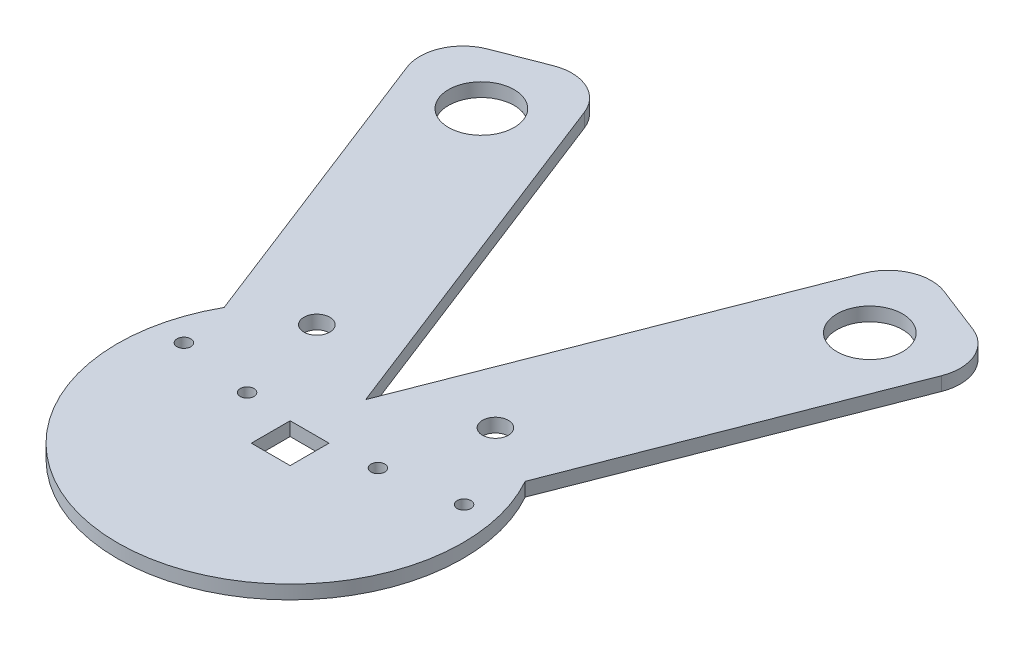
ISO-10303-21;
HEADER;
FILE_DESCRIPTION(('STEP AP214'),'2;1');
FILE_NAME('part.step','',(''),(''),'','','');
FILE_SCHEMA(('AUTOMOTIVE_DESIGN { 1 0 10303 214 1 1 1 1 }'));
ENDSEC;
DATA;
#1=APPLICATION_CONTEXT('core data for automotive mechanical design processes');
#2=APPLICATION_PROTOCOL_DEFINITION('international standard','automotive_design',2000,#1);
#3=PRODUCT_CONTEXT('',#1,'mechanical');
#4=PRODUCT('Part','Part','',(#3));
#5=PRODUCT_RELATED_PRODUCT_CATEGORY('part','',(#4));
#6=PRODUCT_DEFINITION_FORMATION('','',#4);
#7=PRODUCT_DEFINITION_CONTEXT('part definition',#1,'design');
#8=PRODUCT_DEFINITION('design','',#6,#7);
#9=PRODUCT_DEFINITION_SHAPE('','',#8);
#10=(LENGTH_UNIT() NAMED_UNIT(*) SI_UNIT(.MILLI.,.METRE.));
#11=(NAMED_UNIT(*) PLANE_ANGLE_UNIT() SI_UNIT($,.RADIAN.));
#12=(NAMED_UNIT(*) SI_UNIT($,.STERADIAN.) SOLID_ANGLE_UNIT());
#13=UNCERTAINTY_MEASURE_WITH_UNIT(LENGTH_MEASURE(1.E-05),#10,'distance_accuracy_value','');
#14=(GEOMETRIC_REPRESENTATION_CONTEXT(3) GLOBAL_UNCERTAINTY_ASSIGNED_CONTEXT((#13)) GLOBAL_UNIT_ASSIGNED_CONTEXT((#10,
#11,#12)) REPRESENTATION_CONTEXT('',''));
#15=CARTESIAN_POINT('',(0.,0.,0.));
#16=DIRECTION('',(0.,0.,1.));
#17=DIRECTION('',(1.,0.,0.));
#18=AXIS2_PLACEMENT_3D('',#15,#16,#17);
#19=CARTESIAN_POINT('',(20.6861654866838,3.175,-26.8701921611964));
#20=DIRECTION('',(0.,-1.,0.));
#21=DIRECTION('',(0.,0.,-1.));
#22=AXIS2_PLACEMENT_3D('',#19,#20,#21);
#23=CYLINDRICAL_SURFACE('',#22,3.);
#24=CARTESIAN_POINT('',(20.6861654866838,3.175,-26.8701921611964));
#25=DIRECTION('',(0.,-1.,0.));
#26=DIRECTION('',(0.,0.,1.));
#27=AXIS2_PLACEMENT_3D('',#24,#25,#26);
#28=CIRCLE('',#27,3.);
#29=CARTESIAN_POINT('',(20.6861654866838,3.175,-23.8701921611964));
#30=VERTEX_POINT('',#29);
#31=EDGE_CURVE('E48',#30,#30,#28,.T.);
#32=ORIENTED_EDGE('',*,*,#31,.F.);
#33=EDGE_LOOP('',(#32));
#34=FACE_BOUND('',#33,.T.);
#35=CARTESIAN_POINT('',(20.6861654866838,0.,-26.8701921611964));
#36=DIRECTION('',(0.,-1.,0.));
#37=DIRECTION('',(0.,0.,1.));
#38=AXIS2_PLACEMENT_3D('',#35,#36,#37);
#39=CIRCLE('',#38,3.);
#40=CARTESIAN_POINT('',(20.6861654866838,0.,-23.8701921611964));
#41=VERTEX_POINT('',#40);
#42=EDGE_CURVE('E11',#41,#41,#39,.T.);
#43=ORIENTED_EDGE('',*,*,#42,.T.);
#44=EDGE_LOOP('',(#43));
#45=FACE_BOUND('',#44,.T.);
#46=ADVANCED_FACE('F41',(#34,#45),#23,.F.);
#47=CARTESIAN_POINT('',(15.1611537875851,3.175,-5.18156044490732));
#48=DIRECTION('',(0.,-1.,0.));
#49=DIRECTION('',(0.,0.,-1.));
#50=AXIS2_PLACEMENT_3D('',#47,#48,#49);
#51=CYLINDRICAL_SURFACE('',#50,1.6);
#52=CARTESIAN_POINT('',(15.1611537875851,3.175,-5.18156044490732));
#53=DIRECTION('',(0.,-1.,0.));
#54=DIRECTION('',(0.,0.,1.));
#55=AXIS2_PLACEMENT_3D('',#52,#53,#54);
#56=CIRCLE('',#55,1.6);
#57=CARTESIAN_POINT('',(15.1611537875851,3.175,-3.58156044490732));
#58=VERTEX_POINT('',#57);
#59=EDGE_CURVE('E223',#58,#58,#56,.T.);
#60=ORIENTED_EDGE('',*,*,#59,.F.);
#61=EDGE_LOOP('',(#60));
#62=FACE_BOUND('',#61,.T.);
#63=CARTESIAN_POINT('',(15.1611537875851,0.,-5.18156044490732));
#64=DIRECTION('',(0.,-1.,0.));
#65=DIRECTION('',(0.,0.,1.));
#66=AXIS2_PLACEMENT_3D('',#63,#64,#65);
#67=CIRCLE('',#66,1.6);
#68=CARTESIAN_POINT('',(15.1611537875851,0.,-3.58156044490732));
#69=VERTEX_POINT('',#68);
#70=EDGE_CURVE('E226',#69,#69,#67,.T.);
#71=ORIENTED_EDGE('',*,*,#70,.T.);
#72=EDGE_LOOP('',(#71));
#73=FACE_BOUND('',#72,.T.);
#74=ADVANCED_FACE('F235',(#62,#73),#51,.F.);
#75=CARTESIAN_POINT('',(32.4587779712596,3.175,-7.83527437077746));
#76=DIRECTION('',(0.,-1.,0.));
#77=DIRECTION('',(0.,0.,-1.));
#78=AXIS2_PLACEMENT_3D('',#75,#76,#77);
#79=CYLINDRICAL_SURFACE('',#78,1.6);
#80=CARTESIAN_POINT('',(32.4587779712596,3.175,-7.83527437077746));
#81=DIRECTION('',(0.,-1.,0.));
#82=DIRECTION('',(0.,0.,1.));
#83=AXIS2_PLACEMENT_3D('',#80,#81,#82);
#84=CIRCLE('',#83,1.6);
#85=CARTESIAN_POINT('',(32.4587779712596,3.175,-6.23527437077746));
#86=VERTEX_POINT('',#85);
#87=EDGE_CURVE('E217',#86,#86,#84,.T.);
#88=ORIENTED_EDGE('',*,*,#87,.F.);
#89=EDGE_LOOP('',(#88));
#90=FACE_BOUND('',#89,.T.);
#91=CARTESIAN_POINT('',(32.4587779712596,0.,-7.83527437077746));
#92=DIRECTION('',(0.,-1.,0.));
#93=DIRECTION('',(0.,0.,1.));
#94=AXIS2_PLACEMENT_3D('',#91,#92,#93);
#95=CIRCLE('',#94,1.6);
#96=CARTESIAN_POINT('',(32.4587779712596,0.,-6.23527437077746));
#97=VERTEX_POINT('',#96);
#98=EDGE_CURVE('E220',#97,#97,#95,.T.);
#99=ORIENTED_EDGE('',*,*,#98,.T.);
#100=EDGE_LOOP('',(#99));
#101=FACE_BOUND('',#100,.T.);
#102=ADVANCED_FACE('F400',(#90,#101),#79,.F.);
#103=CARTESIAN_POINT('',(4.5,3.175,0.));
#104=DIRECTION('',(-1.,0.,0.));
#105=DIRECTION('',(0.,0.,1.));
#106=AXIS2_PLACEMENT_3D('',#103,#104,#105);
#107=PLANE('',#106);
#108=DIRECTION('',(0.,0.,-1.));
#109=VECTOR('',#108,1.);
#110=CARTESIAN_POINT('',(4.5,0.,0.));
#111=LINE('',#110,#109);
#112=CARTESIAN_POINT('',(4.5,0.,4.5));
#113=VERTEX_POINT('',#112);
#114=CARTESIAN_POINT('',(4.5,0.,-4.5));
#115=VERTEX_POINT('',#114);
#116=EDGE_CURVE('E270',#113,#115,#111,.T.);
#117=ORIENTED_EDGE('',*,*,#116,.F.);
#118=DIRECTION('',(0.,-1.,0.));
#119=VECTOR('',#118,1.);
#120=CARTESIAN_POINT('',(4.5,3.175,4.5));
#121=LINE('',#120,#119);
#122=CARTESIAN_POINT('',(4.5,3.175,4.5));
#123=VERTEX_POINT('',#122);
#124=EDGE_CURVE('E186',#123,#113,#121,.T.);
#125=ORIENTED_EDGE('',*,*,#124,.F.);
#126=DIRECTION('',(0.,0.,-1.));
#127=VECTOR('',#126,1.);
#128=CARTESIAN_POINT('',(4.5,3.175,0.));
#129=LINE('',#128,#127);
#130=CARTESIAN_POINT('',(4.5,3.175,-4.5));
#131=VERTEX_POINT('',#130);
#132=EDGE_CURVE('E332',#123,#131,#129,.T.);
#133=ORIENTED_EDGE('',*,*,#132,.T.);
#134=DIRECTION('',(0.,-1.,0.));
#135=VECTOR('',#134,1.);
#136=CARTESIAN_POINT('',(4.5,3.175,-4.5));
#137=LINE('',#136,#135);
#138=EDGE_CURVE('E173',#131,#115,#137,.T.);
#139=ORIENTED_EDGE('',*,*,#138,.T.);
#140=EDGE_LOOP('',(#117,#125,#133,#139));
#141=FACE_BOUND('',#140,.T.);
#142=ADVANCED_FACE('F330',(#141),#107,.T.);
#143=CARTESIAN_POINT('',(0.,3.175,4.5));
#144=DIRECTION('',(0.,0.,-1.));
#145=DIRECTION('',(-1.,0.,0.));
#146=AXIS2_PLACEMENT_3D('',#143,#144,#145);
#147=PLANE('',#146);
#148=DIRECTION('',(1.,0.,0.));
#149=VECTOR('',#148,1.);
#150=CARTESIAN_POINT('',(0.,0.,4.5));
#151=LINE('',#150,#149);
#152=CARTESIAN_POINT('',(-4.5,0.,4.5));
#153=VERTEX_POINT('',#152);
#154=EDGE_CURVE('E314',#153,#113,#151,.T.);
#155=ORIENTED_EDGE('',*,*,#154,.F.);
#156=DIRECTION('',(0.,-1.,0.));
#157=VECTOR('',#156,1.);
#158=CARTESIAN_POINT('',(-4.5,3.175,4.5));
#159=LINE('',#158,#157);
#160=CARTESIAN_POINT('',(-4.5,3.175,4.5));
#161=VERTEX_POINT('',#160);
#162=EDGE_CURVE('E283',#161,#153,#159,.T.);
#163=ORIENTED_EDGE('',*,*,#162,.F.);
#164=DIRECTION('',(1.,0.,0.));
#165=VECTOR('',#164,1.);
#166=CARTESIAN_POINT('',(0.,3.175,4.5));
#167=LINE('',#166,#165);
#168=EDGE_CURVE('E326',#161,#123,#167,.T.);
#169=ORIENTED_EDGE('',*,*,#168,.T.);
#170=ORIENTED_EDGE('',*,*,#124,.T.);
#171=EDGE_LOOP('',(#155,#163,#169,#170));
#172=FACE_BOUND('',#171,.T.);
#173=ADVANCED_FACE('F323',(#172),#147,.T.);
#174=CARTESIAN_POINT('',(-4.5,3.175,0.));
#175=DIRECTION('',(-1.,0.,0.));
#176=DIRECTION('',(0.,0.,1.));
#177=AXIS2_PLACEMENT_3D('',#174,#175,#176);
#178=PLANE('',#177);
#179=DIRECTION('',(0.,0.,-1.));
#180=VECTOR('',#179,1.);
#181=CARTESIAN_POINT('',(-4.5,0.,0.));
#182=LINE('',#181,#180);
#183=CARTESIAN_POINT('',(-4.5,0.,-4.5));
#184=VERTEX_POINT('',#183);
#185=EDGE_CURVE('E277',#153,#184,#182,.T.);
#186=ORIENTED_EDGE('',*,*,#185,.T.);
#187=DIRECTION('',(0.,-1.,0.));
#188=VECTOR('',#187,1.);
#189=CARTESIAN_POINT('',(-4.5,3.175,-4.5));
#190=LINE('',#189,#188);
#191=CARTESIAN_POINT('',(-4.5,3.175,-4.5));
#192=VERTEX_POINT('',#191);
#193=EDGE_CURVE('E176',#192,#184,#190,.T.);
#194=ORIENTED_EDGE('',*,*,#193,.F.);
#195=DIRECTION('',(0.,0.,-1.));
#196=VECTOR('',#195,1.);
#197=CARTESIAN_POINT('',(-4.5,3.175,0.));
#198=LINE('',#197,#196);
#199=EDGE_CURVE('E291',#161,#192,#198,.T.);
#200=ORIENTED_EDGE('',*,*,#199,.F.);
#201=ORIENTED_EDGE('',*,*,#162,.T.);
#202=EDGE_LOOP('',(#186,#194,#200,#201));
#203=FACE_BOUND('',#202,.T.);
#204=ADVANCED_FACE('F319',(#203),#178,.F.);
#205=CARTESIAN_POINT('',(0.,3.175,0.));
#206=DIRECTION('',(0.,-1.,0.));
#207=DIRECTION('',(0.,0.,-1.));
#208=AXIS2_PLACEMENT_3D('',#205,#206,#207);
#209=CYLINDRICAL_SURFACE('',#208,40.);
#210=CARTESIAN_POINT('',(0.,0.,0.));
#211=DIRECTION('',(0.,1.,0.));
#212=DIRECTION('',(0.,0.,1.));
#213=AXIS2_PLACEMENT_3D('',#210,#211,#212);
#214=CIRCLE('',#213,40.);
#215=CARTESIAN_POINT('',(-34.8820737006286,0.,-19.5765404079454));
#216=VERTEX_POINT('',#215);
#217=CARTESIAN_POINT('',(34.8820737006286,0.,-19.5765404079454));
#218=VERTEX_POINT('',#217);
#219=EDGE_CURVE('E172',#216,#218,#214,.T.);
#220=ORIENTED_EDGE('',*,*,#219,.T.);
#221=DIRECTION('',(0.,-1.,0.));
#222=VECTOR('',#221,1.);
#223=CARTESIAN_POINT('',(34.8820737006286,3.175,-19.5765404079454));
#224=LINE('',#223,#222);
#225=CARTESIAN_POINT('',(34.8820737006286,3.175,-19.5765404079454));
#226=VERTEX_POINT('',#225);
#227=EDGE_CURVE('E153',#226,#218,#224,.T.);
#228=ORIENTED_EDGE('',*,*,#227,.F.);
#229=CARTESIAN_POINT('',(0.,3.175,0.));
#230=DIRECTION('',(0.,1.,0.));
#231=DIRECTION('',(0.,0.,1.));
#232=AXIS2_PLACEMENT_3D('',#229,#230,#231);
#233=CIRCLE('',#232,40.);
#234=CARTESIAN_POINT('',(-34.8820737006286,3.175,-19.5765404079454));
#235=VERTEX_POINT('',#234);
#236=EDGE_CURVE('E159',#235,#226,#233,.T.);
#237=ORIENTED_EDGE('',*,*,#236,.F.);
#238=DIRECTION('',(0.,-1.,0.));
#239=VECTOR('',#238,1.);
#240=CARTESIAN_POINT('',(-34.8820737006286,3.175,-19.5765404079454));
#241=LINE('',#240,#239);
#242=EDGE_CURVE('E179',#235,#216,#241,.T.);
#243=ORIENTED_EDGE('',*,*,#242,.T.);
#244=EDGE_LOOP('',(#220,#228,#237,#243));
#245=FACE_BOUND('',#244,.T.);
#246=ADVANCED_FACE('F170',(#245),#209,.T.);
#247=CARTESIAN_POINT('',(23.6685022200159,3.175,9.21748353191391));
#248=DIRECTION('',(-0.931830796063617,0.,-0.362893052437555));
#249=DIRECTION('',(-0.362893052437555,0.,0.931830796063617));
#250=AXIS2_PLACEMENT_3D('',#247,#248,#249);
#251=PLANE('',#250);
#252=DIRECTION('',(0.362893052437555,0.,-0.931830796063617));
#253=VECTOR('',#252,1.);
#254=CARTESIAN_POINT('',(23.6685022200159,0.,9.21748353191391));
#255=LINE('',#254,#253);
#256=CARTESIAN_POINT('',(61.9248105705805,0.,-89.0164342168864));
#257=VERTEX_POINT('',#256);
#258=EDGE_CURVE('E296',#218,#257,#255,.T.);
#259=ORIENTED_EDGE('',*,*,#258,.T.);
#260=DIRECTION('',(0.,-1.,0.));
#261=VECTOR('',#260,1.);
#262=CARTESIAN_POINT('',(61.9248105705805,3.175,-89.0164342168863));
#263=LINE('',#262,#261);
#264=CARTESIAN_POINT('',(61.9248105705805,3.175,-89.0164342168864));
#265=VERTEX_POINT('',#264);
#266=EDGE_CURVE('E156',#257,#265,#263,.F.);
#267=ORIENTED_EDGE('',*,*,#266,.T.);
#268=DIRECTION('',(0.362893052437555,0.,-0.931830796063617));
#269=VECTOR('',#268,1.);
#270=CARTESIAN_POINT('',(23.6685022200159,3.175,9.21748353191391));
#271=LINE('',#270,#269);
#272=EDGE_CURVE('E148',#226,#265,#271,.T.);
#273=ORIENTED_EDGE('',*,*,#272,.F.);
#274=ORIENTED_EDGE('',*,*,#227,.T.);
#275=EDGE_LOOP('',(#259,#267,#273,#274));
#276=FACE_BOUND('',#275,.T.);
#277=ADVANCED_FACE('F151',(#276),#251,.F.);
#278=CARTESIAN_POINT('',(41.8852388749403,3.175,-107.552225709436));
#279=DIRECTION('',(0.362893052437556,0.,-0.931830796063617));
#280=DIRECTION('',(-0.931830796063617,0.,-0.362893052437556));
#281=AXIS2_PLACEMENT_3D('',#278,#279,#280);
#282=PLANE('',#281);
#283=DIRECTION('',(0.931830796063617,0.,0.362893052437556));
#284=VECTOR('',#283,1.);
#285=CARTESIAN_POINT('',(41.8852388749403,3.175,-107.552225709436));
#286=LINE('',#285,#284);
#287=CARTESIAN_POINT('',(45.2864212805724,3.175,-106.227666068039));
#288=VERTEX_POINT('',#287);
#289=CARTESIAN_POINT('',(56.2354331343199,3.175,-101.963672701898));
#290=VERTEX_POINT('',#289);
#291=EDGE_CURVE('E158',#288,#290,#286,.T.);
#292=ORIENTED_EDGE('',*,*,#291,.T.);
#293=DIRECTION('',(0.,-1.,0.));
#294=VECTOR('',#293,1.);
#295=CARTESIAN_POINT('',(56.2354331343199,0.,-101.963672701898));
#296=LINE('',#295,#294);
#297=CARTESIAN_POINT('',(56.2354331343199,0.,-101.963672701898));
#298=VERTEX_POINT('',#297);
#299=EDGE_CURVE('E185',#290,#298,#296,.T.);
#300=ORIENTED_EDGE('',*,*,#299,.T.);
#301=DIRECTION('',(0.931830796063617,0.,0.362893052437556));
#302=VECTOR('',#301,1.);
#303=CARTESIAN_POINT('',(41.8852388749403,0.,-107.552225709436));
#304=LINE('',#303,#302);
#305=CARTESIAN_POINT('',(45.2864212805724,0.,-106.227666068039));
#306=VERTEX_POINT('',#305);
#307=EDGE_CURVE('E249',#306,#298,#304,.T.);
#308=ORIENTED_EDGE('',*,*,#307,.F.);
#309=DIRECTION('',(0.,-1.,0.));
#310=VECTOR('',#309,1.);
#311=CARTESIAN_POINT('',(45.2864212805724,3.175,-106.227666068039));
#312=LINE('',#311,#310);
#313=EDGE_CURVE('E183',#306,#288,#312,.F.);
#314=ORIENTED_EDGE('',*,*,#313,.T.);
#315=EDGE_LOOP('',(#292,#300,#308,#314));
#316=FACE_BOUND('',#315,.T.);
#317=ADVANCED_FACE('F365',(#316),#282,.T.);
#318=CARTESIAN_POINT('',(-5.91712555500396,3.175,-2.30437088297848));
#319=DIRECTION('',(-0.931830796063617,0.,-0.362893052437556));
#320=DIRECTION('',(-0.362893052437556,0.,0.931830796063617));
#321=AXIS2_PLACEMENT_3D('',#318,#319,#320);
#322=PLANE('',#321);
#323=DIRECTION('',(0.362893052437556,0.,-0.931830796063617));
#324=VECTOR('',#323,1.);
#325=CARTESIAN_POINT('',(-5.91712555500396,3.175,-2.30437088297848));
#326=LINE('',#325,#324);
#327=CARTESIAN_POINT('',(0.,3.175,-17.4982683116885));
#328=VERTEX_POINT('',#327);
#329=CARTESIAN_POINT('',(32.3391827955607,3.175,-100.538288631779));
#330=VERTEX_POINT('',#329);
#331=EDGE_CURVE('E358',#328,#330,#326,.T.);
#332=ORIENTED_EDGE('',*,*,#331,.T.);
#333=DIRECTION('',(0.,-1.,0.));
#334=VECTOR('',#333,1.);
#335=CARTESIAN_POINT('',(32.3391827955607,3.175,-100.538288631779));
#336=LINE('',#335,#334);
#337=CARTESIAN_POINT('',(32.3391827955607,0.,-100.538288631779));
#338=VERTEX_POINT('',#337);
#339=EDGE_CURVE('E204',#330,#338,#336,.T.);
#340=ORIENTED_EDGE('',*,*,#339,.T.);
#341=DIRECTION('',(0.362893052437556,0.,-0.931830796063617));
#342=VECTOR('',#341,1.);
#343=CARTESIAN_POINT('',(-5.91712555500396,0.,-2.30437088297848));
#344=LINE('',#343,#342);
#345=CARTESIAN_POINT('',(0.,0.,-17.4982683116885));
#346=VERTEX_POINT('',#345);
#347=EDGE_CURVE('E299',#346,#338,#344,.T.);
#348=ORIENTED_EDGE('',*,*,#347,.F.);
#349=DIRECTION('',(0.,-1.,0.));
#350=VECTOR('',#349,1.);
#351=CARTESIAN_POINT('',(0.,3.175,-17.4982683116885));
#352=LINE('',#351,#350);
#353=EDGE_CURVE('E174',#328,#346,#352,.T.);
#354=ORIENTED_EDGE('',*,*,#353,.F.);
#355=EDGE_LOOP('',(#332,#340,#348,#354));
#356=FACE_BOUND('',#355,.T.);
#357=ADVANCED_FACE('F448',(#356),#322,.T.);
#358=CARTESIAN_POINT('',(5.91712555500396,3.175,-2.30437088297848));
#359=DIRECTION('',(0.931830796063617,0.,-0.362893052437556));
#360=DIRECTION('',(-0.362893052437556,0.,-0.931830796063617));
#361=AXIS2_PLACEMENT_3D('',#358,#359,#360);
#362=PLANE('',#361);
#363=DIRECTION('',(0.362893052437556,0.,0.931830796063617));
#364=VECTOR('',#363,1.);
#365=CARTESIAN_POINT('',(5.91712555500396,0.,-2.30437088297848));
#366=LINE('',#365,#364);
#367=CARTESIAN_POINT('',(-32.3391827955607,0.,-100.538288631779));
#368=VERTEX_POINT('',#367);
#369=EDGE_CURVE('E302',#368,#346,#366,.T.);
#370=ORIENTED_EDGE('',*,*,#369,.F.);
#371=DIRECTION('',(0.,-1.,0.));
#372=VECTOR('',#371,1.);
#373=CARTESIAN_POINT('',(-32.3391827955607,3.175,-100.538288631779));
#374=LINE('',#373,#372);
#375=CARTESIAN_POINT('',(-32.3391827955607,3.175,-100.538288631779));
#376=VERTEX_POINT('',#375);
#377=EDGE_CURVE('E212',#368,#376,#374,.F.);
#378=ORIENTED_EDGE('',*,*,#377,.T.);
#379=DIRECTION('',(0.362893052437556,0.,0.931830796063617));
#380=VECTOR('',#379,1.);
#381=CARTESIAN_POINT('',(5.91712555500396,3.175,-2.30437088297848));
#382=LINE('',#381,#380);
#383=EDGE_CURVE('E356',#376,#328,#382,.T.);
#384=ORIENTED_EDGE('',*,*,#383,.T.);
#385=ORIENTED_EDGE('',*,*,#353,.T.);
#386=EDGE_LOOP('',(#370,#378,#384,#385));
#387=FACE_BOUND('',#386,.T.);
#388=ADVANCED_FACE('F384',(#387),#362,.T.);
#389=CARTESIAN_POINT('',(-41.8852388749402,3.175,-107.552225709436));
#390=DIRECTION('',(-0.362893052437555,0.,-0.931830796063617));
#391=DIRECTION('',(-0.931830796063617,0.,0.362893052437555));
#392=AXIS2_PLACEMENT_3D('',#389,#390,#391);
#393=PLANE('',#392);
#394=DIRECTION('',(0.931830796063617,0.,-0.362893052437555));
#395=VECTOR('',#394,1.);
#396=CARTESIAN_POINT('',(-41.8852388749402,3.175,-107.552225709436));
#397=LINE('',#396,#395);
#398=CARTESIAN_POINT('',(-56.2354331343199,3.175,-101.963672701898));
#399=VERTEX_POINT('',#398);
#400=CARTESIAN_POINT('',(-45.2864212805724,3.175,-106.227666068039));
#401=VERTEX_POINT('',#400);
#402=EDGE_CURVE('E354',#399,#401,#397,.T.);
#403=ORIENTED_EDGE('',*,*,#402,.T.);
#404=DIRECTION('',(0.,-1.,0.));
#405=VECTOR('',#404,1.);
#406=CARTESIAN_POINT('',(-45.2864212805724,3.175,-106.227666068039));
#407=LINE('',#406,#405);
#408=CARTESIAN_POINT('',(-45.2864212805724,0.,-106.227666068039));
#409=VERTEX_POINT('',#408);
#410=EDGE_CURVE('E209',#401,#409,#407,.T.);
#411=ORIENTED_EDGE('',*,*,#410,.T.);
#412=DIRECTION('',(0.931830796063617,0.,-0.362893052437555));
#413=VECTOR('',#412,1.);
#414=CARTESIAN_POINT('',(-41.8852388749402,0.,-107.552225709436));
#415=LINE('',#414,#413);
#416=CARTESIAN_POINT('',(-56.2354331343199,0.,-101.963672701898));
#417=VERTEX_POINT('',#416);
#418=EDGE_CURVE('E304',#417,#409,#415,.T.);
#419=ORIENTED_EDGE('',*,*,#418,.F.);
#420=DIRECTION('',(0.,-1.,0.));
#421=VECTOR('',#420,1.);
#422=CARTESIAN_POINT('',(-56.2354331343199,3.175,-101.963672701898));
#423=LINE('',#422,#421);
#424=EDGE_CURVE('E207',#417,#399,#423,.F.);
#425=ORIENTED_EDGE('',*,*,#424,.T.);
#426=EDGE_LOOP('',(#403,#411,#419,#425));
#427=FACE_BOUND('',#426,.T.);
#428=ADVANCED_FACE('F378',(#427),#393,.T.);
#429=CARTESIAN_POINT('',(0.,3.175,-4.5));
#430=DIRECTION('',(0.,0.,-1.));
#431=DIRECTION('',(-1.,0.,0.));
#432=AXIS2_PLACEMENT_3D('',#429,#430,#431);
#433=PLANE('',#432);
#434=DIRECTION('',(1.,0.,0.));
#435=VECTOR('',#434,1.);
#436=CARTESIAN_POINT('',(0.,0.,-4.5));
#437=LINE('',#436,#435);
#438=EDGE_CURVE('E274',#184,#115,#437,.T.);
#439=ORIENTED_EDGE('',*,*,#438,.T.);
#440=ORIENTED_EDGE('',*,*,#138,.F.);
#441=DIRECTION('',(1.,0.,0.));
#442=VECTOR('',#441,1.);
#443=CARTESIAN_POINT('',(0.,3.175,-4.5));
#444=LINE('',#443,#442);
#445=EDGE_CURVE('E287',#192,#131,#444,.T.);
#446=ORIENTED_EDGE('',*,*,#445,.F.);
#447=ORIENTED_EDGE('',*,*,#193,.T.);
#448=EDGE_LOOP('',(#439,#440,#446,#447));
#449=FACE_BOUND('',#448,.T.);
#450=ADVANCED_FACE('F334',(#449),#433,.F.);
#451=CARTESIAN_POINT('',(45.,3.175,-89.3028554974588));
#452=DIRECTION('',(0.,-1.,0.));
#453=DIRECTION('',(0.,0.,-1.));
#454=AXIS2_PLACEMENT_3D('',#451,#452,#453);
#455=CYLINDRICAL_SURFACE('',#454,7.6);
#456=CARTESIAN_POINT('',(45.,3.175,-89.3028554974588));
#457=DIRECTION('',(0.,1.,0.));
#458=DIRECTION('',(0.,0.,1.));
#459=AXIS2_PLACEMENT_3D('',#456,#457,#458);
#460=CIRCLE('',#459,7.6);
#461=CARTESIAN_POINT('',(45.,3.175,-81.7028554974588));
#462=VERTEX_POINT('',#461);
#463=EDGE_CURVE('E341',#462,#462,#460,.T.);
#464=ORIENTED_EDGE('',*,*,#463,.T.);
#465=EDGE_LOOP('',(#464));
#466=FACE_BOUND('',#465,.T.);
#467=CARTESIAN_POINT('',(45.,0.,-89.3028554974588));
#468=DIRECTION('',(0.,1.,0.));
#469=DIRECTION('',(0.,0.,1.));
#470=AXIS2_PLACEMENT_3D('',#467,#468,#469);
#471=CIRCLE('',#470,7.6);
#472=CARTESIAN_POINT('',(45.,0.,-81.7028554974588));
#473=VERTEX_POINT('',#472);
#474=EDGE_CURVE('E265',#473,#473,#471,.T.);
#475=ORIENTED_EDGE('',*,*,#474,.F.);
#476=EDGE_LOOP('',(#475));
#477=FACE_BOUND('',#476,.T.);
#478=ADVANCED_FACE('F420',(#466,#477),#455,.F.);
#479=CARTESIAN_POINT('',(-45.,3.175,-89.3028554974588));
#480=DIRECTION('',(0.,-1.,0.));
#481=DIRECTION('',(0.,0.,-1.));
#482=AXIS2_PLACEMENT_3D('',#479,#480,#481);
#483=CYLINDRICAL_SURFACE('',#482,7.6);
#484=CARTESIAN_POINT('',(-45.,3.175,-89.3028554974588));
#485=DIRECTION('',(0.,1.,0.));
#486=DIRECTION('',(0.,0.,1.));
#487=AXIS2_PLACEMENT_3D('',#484,#485,#486);
#488=CIRCLE('',#487,7.6);
#489=CARTESIAN_POINT('',(-45.,3.175,-81.7028554974588));
#490=VERTEX_POINT('',#489);
#491=EDGE_CURVE('E344',#490,#490,#488,.T.);
#492=ORIENTED_EDGE('',*,*,#491,.T.);
#493=EDGE_LOOP('',(#492));
#494=FACE_BOUND('',#493,.T.);
#495=CARTESIAN_POINT('',(-45.,0.,-89.3028554974588));
#496=DIRECTION('',(0.,1.,0.));
#497=DIRECTION('',(0.,0.,1.));
#498=AXIS2_PLACEMENT_3D('',#495,#496,#497);
#499=CIRCLE('',#498,7.6);
#500=CARTESIAN_POINT('',(-45.,0.,-81.7028554974588));
#501=VERTEX_POINT('',#500);
#502=EDGE_CURVE('E261',#501,#501,#499,.T.);
#503=ORIENTED_EDGE('',*,*,#502,.F.);
#504=EDGE_LOOP('',(#503));
#505=FACE_BOUND('',#504,.T.);
#506=ADVANCED_FACE('F429',(#494,#505),#483,.F.);
#507=CARTESIAN_POINT('',(-20.6861654866838,3.175,-26.8701921611964));
#508=DIRECTION('',(0.,-1.,0.));
#509=DIRECTION('',(0.,0.,-1.));
#510=AXIS2_PLACEMENT_3D('',#507,#508,#509);
#511=CYLINDRICAL_SURFACE('',#510,3.);
#512=CARTESIAN_POINT('',(-20.6861654866838,3.175,-26.8701921611964));
#513=DIRECTION('',(0.,1.,0.));
#514=DIRECTION('',(0.,0.,1.));
#515=AXIS2_PLACEMENT_3D('',#512,#513,#514);
#516=CIRCLE('',#515,3.);
#517=CARTESIAN_POINT('',(-20.6861654866838,3.175,-23.8701921611964));
#518=VERTEX_POINT('',#517);
#519=EDGE_CURVE('E347',#518,#518,#516,.T.);
#520=ORIENTED_EDGE('',*,*,#519,.T.);
#521=EDGE_LOOP('',(#520));
#522=FACE_BOUND('',#521,.T.);
#523=CARTESIAN_POINT('',(-20.6861654866838,0.,-26.8701921611964));
#524=DIRECTION('',(0.,1.,0.));
#525=DIRECTION('',(0.,0.,1.));
#526=AXIS2_PLACEMENT_3D('',#523,#524,#525);
#527=CIRCLE('',#526,3.);
#528=CARTESIAN_POINT('',(-20.6861654866838,0.,-23.8701921611964));
#529=VERTEX_POINT('',#528);
#530=EDGE_CURVE('E257',#529,#529,#527,.T.);
#531=ORIENTED_EDGE('',*,*,#530,.F.);
#532=EDGE_LOOP('',(#531));
#533=FACE_BOUND('',#532,.T.);
#534=ADVANCED_FACE('F433',(#522,#533),#511,.F.);
#535=CARTESIAN_POINT('',(-15.1611537875851,3.175,-5.18156044490732));
#536=DIRECTION('',(0.,-1.,0.));
#537=DIRECTION('',(0.,0.,-1.));
#538=AXIS2_PLACEMENT_3D('',#535,#536,#537);
#539=CYLINDRICAL_SURFACE('',#538,1.6);
#540=CARTESIAN_POINT('',(-15.1611537875851,3.175,-5.18156044490732));
#541=DIRECTION('',(0.,1.,0.));
#542=DIRECTION('',(0.,0.,1.));
#543=AXIS2_PLACEMENT_3D('',#540,#541,#542);
#544=CIRCLE('',#543,1.6);
#545=CARTESIAN_POINT('',(-15.1611537875851,3.175,-3.58156044490732));
#546=VERTEX_POINT('',#545);
#547=EDGE_CURVE('E350',#546,#546,#544,.T.);
#548=ORIENTED_EDGE('',*,*,#547,.T.);
#549=EDGE_LOOP('',(#548));
#550=FACE_BOUND('',#549,.T.);
#551=CARTESIAN_POINT('',(-15.1611537875851,0.,-5.18156044490732));
#552=DIRECTION('',(0.,1.,0.));
#553=DIRECTION('',(0.,0.,1.));
#554=AXIS2_PLACEMENT_3D('',#551,#552,#553);
#555=CIRCLE('',#554,1.6);
#556=CARTESIAN_POINT('',(-15.1611537875851,0.,-3.58156044490732));
#557=VERTEX_POINT('',#556);
#558=EDGE_CURVE('E253',#557,#557,#555,.T.);
#559=ORIENTED_EDGE('',*,*,#558,.F.);
#560=EDGE_LOOP('',(#559));
#561=FACE_BOUND('',#560,.T.);
#562=ADVANCED_FACE('F437',(#550,#561),#539,.F.);
#563=CARTESIAN_POINT('',(-23.6685022200159,3.175,9.21748353191391));
#564=DIRECTION('',(0.931830796063617,0.,-0.362893052437555));
#565=DIRECTION('',(-0.362893052437555,0.,-0.931830796063617));
#566=AXIS2_PLACEMENT_3D('',#563,#564,#565);
#567=PLANE('',#566);
#568=DIRECTION('',(0.362893052437555,0.,0.931830796063617));
#569=VECTOR('',#568,1.);
#570=CARTESIAN_POINT('',(-23.6685022200159,3.175,9.21748353191391));
#571=LINE('',#570,#569);
#572=CARTESIAN_POINT('',(-61.9248105705805,3.175,-89.0164342168864));
#573=VERTEX_POINT('',#572);
#574=EDGE_CURVE('E164',#573,#235,#571,.T.);
#575=ORIENTED_EDGE('',*,*,#574,.F.);
#576=DIRECTION('',(0.,-1.,0.));
#577=VECTOR('',#576,1.);
#578=CARTESIAN_POINT('',(-61.9248105705805,0.,-89.0164342168863));
#579=LINE('',#578,#577);
#580=CARTESIAN_POINT('',(-61.9248105705805,0.,-89.0164342168864));
#581=VERTEX_POINT('',#580);
#582=EDGE_CURVE('E214',#573,#581,#579,.T.);
#583=ORIENTED_EDGE('',*,*,#582,.T.);
#584=DIRECTION('',(0.362893052437555,0.,0.931830796063617));
#585=VECTOR('',#584,1.);
#586=CARTESIAN_POINT('',(-23.6685022200159,0.,9.21748353191391));
#587=LINE('',#586,#585);
#588=EDGE_CURVE('E307',#581,#216,#587,.T.);
#589=ORIENTED_EDGE('',*,*,#588,.T.);
#590=ORIENTED_EDGE('',*,*,#242,.F.);
#591=EDGE_LOOP('',(#575,#583,#589,#590));
#592=FACE_BOUND('',#591,.T.);
#593=ADVANCED_FACE('F372',(#592),#567,.F.);
#594=CARTESIAN_POINT('',(-32.4587779712596,3.175,-7.83527437077746));
#595=DIRECTION('',(0.,-1.,0.));
#596=DIRECTION('',(0.,0.,-1.));
#597=AXIS2_PLACEMENT_3D('',#594,#595,#596);
#598=CYLINDRICAL_SURFACE('',#597,1.6);
#599=CARTESIAN_POINT('',(-32.4587779712596,3.175,-7.83527437077746));
#600=DIRECTION('',(0.,1.,0.));
#601=DIRECTION('',(0.,0.,1.));
#602=AXIS2_PLACEMENT_3D('',#599,#600,#601);
#603=CIRCLE('',#602,1.6);
#604=CARTESIAN_POINT('',(-32.4587779712596,3.175,-6.23527437077746));
#605=VERTEX_POINT('',#604);
#606=EDGE_CURVE('E285',#605,#605,#603,.T.);
#607=ORIENTED_EDGE('',*,*,#606,.T.);
#608=EDGE_LOOP('',(#607));
#609=FACE_BOUND('',#608,.T.);
#610=CARTESIAN_POINT('',(-32.4587779712596,0.,-7.83527437077746));
#611=DIRECTION('',(0.,1.,0.));
#612=DIRECTION('',(0.,0.,1.));
#613=AXIS2_PLACEMENT_3D('',#610,#611,#612);
#614=CIRCLE('',#613,1.6);
#615=CARTESIAN_POINT('',(-32.4587779712596,0.,-6.23527437077746));
#616=VERTEX_POINT('',#615);
#617=EDGE_CURVE('E168',#616,#616,#614,.T.);
#618=ORIENTED_EDGE('',*,*,#617,.F.);
#619=EDGE_LOOP('',(#618));
#620=FACE_BOUND('',#619,.T.);
#621=ADVANCED_FACE('F410',(#609,#620),#598,.F.);
#622=CARTESIAN_POINT('',(0.,3.175,0.));
#623=DIRECTION('',(0.,1.,0.));
#624=DIRECTION('',(0.,0.,1.));
#625=AXIS2_PLACEMENT_3D('',#622,#623,#624);
#626=PLANE('',#625);
#627=ORIENTED_EDGE('',*,*,#87,.T.);
#628=EDGE_LOOP('',(#627));
#629=FACE_BOUND('',#628,.T.);
#630=ORIENTED_EDGE('',*,*,#31,.T.);
#631=EDGE_LOOP('',(#630));
#632=FACE_BOUND('',#631,.T.);
#633=ORIENTED_EDGE('',*,*,#59,.T.);
#634=EDGE_LOOP('',(#633));
#635=FACE_BOUND('',#634,.T.);
#636=ORIENTED_EDGE('',*,*,#272,.T.);
#637=CARTESIAN_POINT('',(52.6065026099444,3.175,-92.6453647412619));
#638=DIRECTION('',(0.,1.,0.));
#639=DIRECTION('',(0.,0.,1.));
#640=AXIS2_PLACEMENT_3D('',#637,#638,#639);
#641=CIRCLE('',#640,10.);
#642=EDGE_CURVE('E202',#265,#290,#641,.T.);
#643=ORIENTED_EDGE('',*,*,#642,.T.);
#644=ORIENTED_EDGE('',*,*,#291,.F.);
#645=CARTESIAN_POINT('',(41.6574907561969,3.175,-96.9093581074031));
#646=DIRECTION('',(0.,1.,0.));
#647=DIRECTION('',(0.,0.,1.));
#648=AXIS2_PLACEMENT_3D('',#645,#646,#647);
#649=CIRCLE('',#648,10.);
#650=EDGE_CURVE('E200',#288,#330,#649,.T.);
#651=ORIENTED_EDGE('',*,*,#650,.T.);
#652=ORIENTED_EDGE('',*,*,#331,.F.);
#653=ORIENTED_EDGE('',*,*,#383,.F.);
#654=CARTESIAN_POINT('',(-41.6574907561969,3.175,-96.9093581074032));
#655=DIRECTION('',(0.,1.,0.));
#656=DIRECTION('',(0.,0.,1.));
#657=AXIS2_PLACEMENT_3D('',#654,#655,#656);
#658=CIRCLE('',#657,10.);
#659=EDGE_CURVE('E61',#376,#401,#658,.T.);
#660=ORIENTED_EDGE('',*,*,#659,.T.);
#661=ORIENTED_EDGE('',*,*,#402,.F.);
#662=CARTESIAN_POINT('',(-52.6065026099444,3.175,-92.6453647412619));
#663=DIRECTION('',(0.,1.,0.));
#664=DIRECTION('',(0.,0.,1.));
#665=AXIS2_PLACEMENT_3D('',#662,#663,#664);
#666=CIRCLE('',#665,10.);
#667=EDGE_CURVE('E55',#399,#573,#666,.T.);
#668=ORIENTED_EDGE('',*,*,#667,.T.);
#669=ORIENTED_EDGE('',*,*,#574,.T.);
#670=ORIENTED_EDGE('',*,*,#236,.T.);
#671=EDGE_LOOP('',(#636,#643,#644,#651,#652,#653,#660,#661,#668,#669,#670));
#672=FACE_BOUND('',#671,.T.);
#673=ORIENTED_EDGE('',*,*,#547,.F.);
#674=EDGE_LOOP('',(#673));
#675=FACE_BOUND('',#674,.T.);
#676=ORIENTED_EDGE('',*,*,#519,.F.);
#677=EDGE_LOOP('',(#676));
#678=FACE_BOUND('',#677,.T.);
#679=ORIENTED_EDGE('',*,*,#491,.F.);
#680=EDGE_LOOP('',(#679));
#681=FACE_BOUND('',#680,.T.);
#682=ORIENTED_EDGE('',*,*,#463,.F.);
#683=EDGE_LOOP('',(#682));
#684=FACE_BOUND('',#683,.T.);
#685=ORIENTED_EDGE('',*,*,#132,.F.);
#686=ORIENTED_EDGE('',*,*,#168,.F.);
#687=ORIENTED_EDGE('',*,*,#199,.T.);
#688=ORIENTED_EDGE('',*,*,#445,.T.);
#689=EDGE_LOOP('',(#685,#686,#687,#688));
#690=FACE_BOUND('',#689,.T.);
#691=ORIENTED_EDGE('',*,*,#606,.F.);
#692=EDGE_LOOP('',(#691));
#693=FACE_BOUND('',#692,.T.);
#694=ADVANCED_FACE('F162',(#629,#632,#635,#672,#675,#678,#681,#684,#690,#693),#626,.T.);
#695=CARTESIAN_POINT('',(0.,0.,0.));
#696=DIRECTION('',(0.,1.,0.));
#697=DIRECTION('',(0.,0.,1.));
#698=AXIS2_PLACEMENT_3D('',#695,#696,#697);
#699=PLANE('',#698);
#700=ORIENTED_EDGE('',*,*,#98,.F.);
#701=EDGE_LOOP('',(#700));
#702=FACE_BOUND('',#701,.T.);
#703=ORIENTED_EDGE('',*,*,#42,.F.);
#704=EDGE_LOOP('',(#703));
#705=FACE_BOUND('',#704,.T.);
#706=ORIENTED_EDGE('',*,*,#70,.F.);
#707=EDGE_LOOP('',(#706));
#708=FACE_BOUND('',#707,.T.);
#709=ORIENTED_EDGE('',*,*,#307,.T.);
#710=CARTESIAN_POINT('',(52.6065026099444,0.,-92.6453647412619));
#711=DIRECTION('',(0.,1.,0.));
#712=DIRECTION('',(0.,0.,1.));
#713=AXIS2_PLACEMENT_3D('',#710,#711,#712);
#714=CIRCLE('',#713,10.);
#715=EDGE_CURVE('E195',#298,#257,#714,.F.);
#716=ORIENTED_EDGE('',*,*,#715,.T.);
#717=ORIENTED_EDGE('',*,*,#258,.F.);
#718=ORIENTED_EDGE('',*,*,#219,.F.);
#719=ORIENTED_EDGE('',*,*,#588,.F.);
#720=CARTESIAN_POINT('',(-52.6065026099444,0.,-92.6453647412619));
#721=DIRECTION('',(0.,1.,0.));
#722=DIRECTION('',(0.,0.,1.));
#723=AXIS2_PLACEMENT_3D('',#720,#721,#722);
#724=CIRCLE('',#723,10.);
#725=EDGE_CURVE('E189',#581,#417,#724,.F.);
#726=ORIENTED_EDGE('',*,*,#725,.T.);
#727=ORIENTED_EDGE('',*,*,#418,.T.);
#728=CARTESIAN_POINT('',(-41.6574907561969,0.,-96.9093581074032));
#729=DIRECTION('',(0.,1.,0.));
#730=DIRECTION('',(0.,0.,1.));
#731=AXIS2_PLACEMENT_3D('',#728,#729,#730);
#732=CIRCLE('',#731,10.);
#733=EDGE_CURVE('E191',#409,#368,#732,.F.);
#734=ORIENTED_EDGE('',*,*,#733,.T.);
#735=ORIENTED_EDGE('',*,*,#369,.T.);
#736=ORIENTED_EDGE('',*,*,#347,.T.);
#737=CARTESIAN_POINT('',(41.6574907561969,0.,-96.9093581074031));
#738=DIRECTION('',(0.,1.,0.));
#739=DIRECTION('',(0.,0.,1.));
#740=AXIS2_PLACEMENT_3D('',#737,#738,#739);
#741=CIRCLE('',#740,10.);
#742=EDGE_CURVE('E193',#338,#306,#741,.F.);
#743=ORIENTED_EDGE('',*,*,#742,.T.);
#744=EDGE_LOOP('',(#709,#716,#717,#718,#719,#726,#727,#734,#735,#736,#743));
#745=FACE_BOUND('',#744,.T.);
#746=ORIENTED_EDGE('',*,*,#558,.T.);
#747=EDGE_LOOP('',(#746));
#748=FACE_BOUND('',#747,.T.);
#749=ORIENTED_EDGE('',*,*,#530,.T.);
#750=EDGE_LOOP('',(#749));
#751=FACE_BOUND('',#750,.T.);
#752=ORIENTED_EDGE('',*,*,#502,.T.);
#753=EDGE_LOOP('',(#752));
#754=FACE_BOUND('',#753,.T.);
#755=ORIENTED_EDGE('',*,*,#474,.T.);
#756=EDGE_LOOP('',(#755));
#757=FACE_BOUND('',#756,.T.);
#758=ORIENTED_EDGE('',*,*,#116,.T.);
#759=ORIENTED_EDGE('',*,*,#438,.F.);
#760=ORIENTED_EDGE('',*,*,#185,.F.);
#761=ORIENTED_EDGE('',*,*,#154,.T.);
#762=EDGE_LOOP('',(#758,#759,#760,#761));
#763=FACE_BOUND('',#762,.T.);
#764=ORIENTED_EDGE('',*,*,#617,.T.);
#765=EDGE_LOOP('',(#764));
#766=FACE_BOUND('',#765,.T.);
#767=ADVANCED_FACE('F238',(#702,#705,#708,#745,#748,#751,#754,#757,#763,#766),#699,.F.);
#768=CARTESIAN_POINT('',(52.6065026099444,3.175,-92.6453647412619));
#769=DIRECTION('',(0.,1.,0.));
#770=DIRECTION('',(0.,0.,1.));
#771=AXIS2_PLACEMENT_3D('',#768,#769,#770);
#772=CYLINDRICAL_SURFACE('',#771,10.);
#773=ORIENTED_EDGE('',*,*,#642,.F.);
#774=ORIENTED_EDGE('',*,*,#266,.F.);
#775=ORIENTED_EDGE('',*,*,#715,.F.);
#776=ORIENTED_EDGE('',*,*,#299,.F.);
#777=EDGE_LOOP('',(#773,#774,#775,#776));
#778=FACE_BOUND('',#777,.T.);
#779=ADVANCED_FACE('F241',(#778),#772,.T.);
#780=CARTESIAN_POINT('',(41.6574907561969,3.175,-96.9093581074031));
#781=DIRECTION('',(0.,-1.,0.));
#782=DIRECTION('',(0.,0.,-1.));
#783=AXIS2_PLACEMENT_3D('',#780,#781,#782);
#784=CYLINDRICAL_SURFACE('',#783,10.);
#785=ORIENTED_EDGE('',*,*,#650,.F.);
#786=ORIENTED_EDGE('',*,*,#313,.F.);
#787=ORIENTED_EDGE('',*,*,#742,.F.);
#788=ORIENTED_EDGE('',*,*,#339,.F.);
#789=EDGE_LOOP('',(#785,#786,#787,#788));
#790=FACE_BOUND('',#789,.T.);
#791=ADVANCED_FACE('F389',(#790),#784,.T.);
#792=CARTESIAN_POINT('',(-41.6574907561969,3.175,-96.9093581074032));
#793=DIRECTION('',(0.,-1.,0.));
#794=DIRECTION('',(0.,0.,-1.));
#795=AXIS2_PLACEMENT_3D('',#792,#793,#794);
#796=CYLINDRICAL_SURFACE('',#795,10.);
#797=ORIENTED_EDGE('',*,*,#659,.F.);
#798=ORIENTED_EDGE('',*,*,#377,.F.);
#799=ORIENTED_EDGE('',*,*,#733,.F.);
#800=ORIENTED_EDGE('',*,*,#410,.F.);
#801=EDGE_LOOP('',(#797,#798,#799,#800));
#802=FACE_BOUND('',#801,.T.);
#803=ADVANCED_FACE('F387',(#802),#796,.T.);
#804=CARTESIAN_POINT('',(-52.6065026099444,3.175,-92.6453647412619));
#805=DIRECTION('',(0.,1.,0.));
#806=DIRECTION('',(0.,0.,1.));
#807=AXIS2_PLACEMENT_3D('',#804,#805,#806);
#808=CYLINDRICAL_SURFACE('',#807,10.);
#809=ORIENTED_EDGE('',*,*,#667,.F.);
#810=ORIENTED_EDGE('',*,*,#424,.F.);
#811=ORIENTED_EDGE('',*,*,#725,.F.);
#812=ORIENTED_EDGE('',*,*,#582,.F.);
#813=EDGE_LOOP('',(#809,#810,#811,#812));
#814=FACE_BOUND('',#813,.T.);
#815=ADVANCED_FACE('F375',(#814),#808,.T.);
#816=CLOSED_SHELL('',(#46,#74,#102,#142,#173,#204,#246,#277,#317,#357,#388,#428,#450,#478,#506,
#534,#562,#593,#621,#694,#767,#779,#791,#803,#815));
#817=MANIFOLD_SOLID_BREP('B2',#816);
#818=ADVANCED_BREP_SHAPE_REPRESENTATION('',(#18,#817),#14);
#819=SHAPE_DEFINITION_REPRESENTATION(#9,#818);
ENDSEC;
END-ISO-10303-21;
